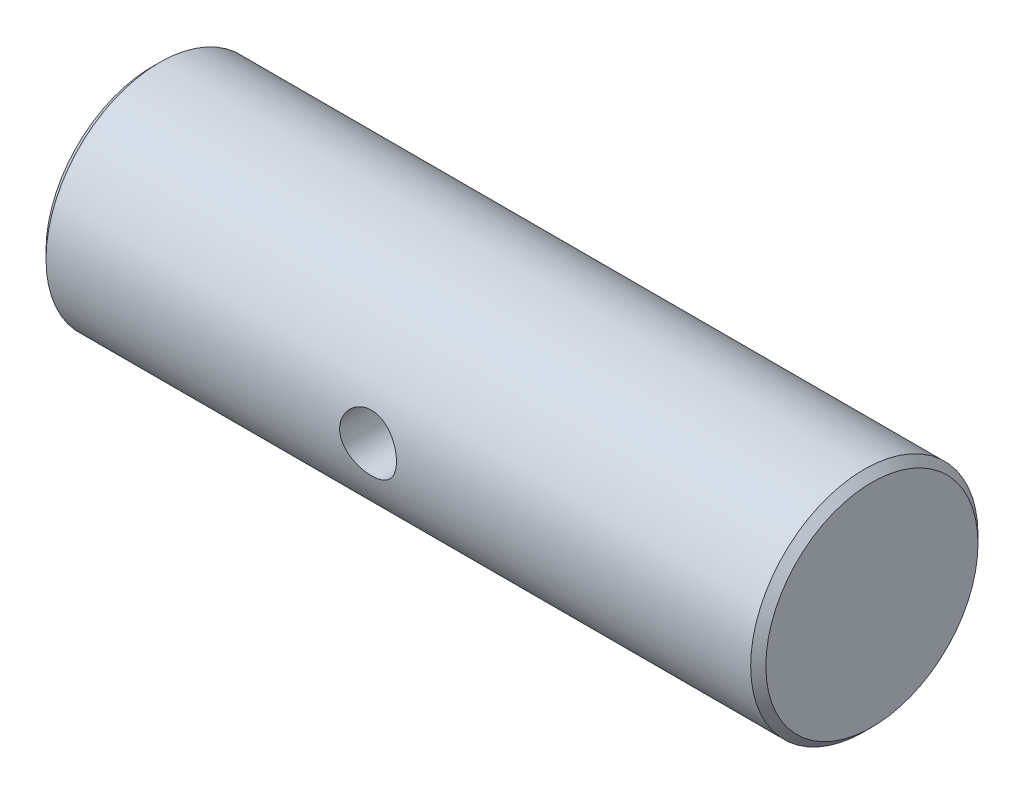
ISO-10303-21;
HEADER;
FILE_DESCRIPTION(('STEP AP214'),'2;1');
FILE_NAME('part.step','',(''),(''),'','','');
FILE_SCHEMA(('AUTOMOTIVE_DESIGN { 1 0 10303 214 1 1 1 1 }'));
ENDSEC;
DATA;
#1=APPLICATION_CONTEXT('core data for automotive mechanical design processes');
#2=APPLICATION_PROTOCOL_DEFINITION('international standard','automotive_design',2000,#1);
#3=PRODUCT_CONTEXT('',#1,'mechanical');
#4=PRODUCT('Part','Part','',(#3));
#5=PRODUCT_RELATED_PRODUCT_CATEGORY('part','',(#4));
#6=PRODUCT_DEFINITION_FORMATION('','',#4);
#7=PRODUCT_DEFINITION_CONTEXT('part definition',#1,'design');
#8=PRODUCT_DEFINITION('design','',#6,#7);
#9=PRODUCT_DEFINITION_SHAPE('','',#8);
#10=(LENGTH_UNIT() NAMED_UNIT(*) SI_UNIT(.MILLI.,.METRE.));
#11=(NAMED_UNIT(*) PLANE_ANGLE_UNIT() SI_UNIT($,.RADIAN.));
#12=(NAMED_UNIT(*) SI_UNIT($,.STERADIAN.) SOLID_ANGLE_UNIT());
#13=UNCERTAINTY_MEASURE_WITH_UNIT(LENGTH_MEASURE(1.E-05),#10,'distance_accuracy_value','');
#14=(GEOMETRIC_REPRESENTATION_CONTEXT(3) GLOBAL_UNCERTAINTY_ASSIGNED_CONTEXT((#13)) GLOBAL_UNIT_ASSIGNED_CONTEXT((#10,
#11,#12)) REPRESENTATION_CONTEXT('',''));
#15=CARTESIAN_POINT('',(0.,0.,0.));
#16=DIRECTION('',(0.,0.,1.));
#17=DIRECTION('',(1.,0.,0.));
#18=AXIS2_PLACEMENT_3D('',#15,#16,#17);
#19=CARTESIAN_POINT('',(-15.,3.,0.));
#20=DIRECTION('',(1.,0.,0.));
#21=DIRECTION('',(0.,0.,-1.));
#22=AXIS2_PLACEMENT_3D('',#19,#20,#21);
#23=PLANE('',#22);
#24=CARTESIAN_POINT('',(-15.,0.,0.));
#25=DIRECTION('',(1.,0.,0.));
#26=DIRECTION('',(0.,0.,-1.));
#27=AXIS2_PLACEMENT_3D('',#24,#25,#26);
#28=CIRCLE('',#27,2.80000000000001);
#29=CARTESIAN_POINT('',(-15.,0.,-2.80000000000001));
#30=VERTEX_POINT('',#29);
#31=EDGE_CURVE('E45',#30,#30,#28,.F.);
#32=ORIENTED_EDGE('',*,*,#31,.T.);
#33=EDGE_LOOP('',(#32));
#34=FACE_BOUND('',#33,.T.);
#35=ADVANCED_FACE('F30',(#34),#23,.F.);
#36=CARTESIAN_POINT('',(4.,3.,0.));
#37=DIRECTION('',(-1.,0.,0.));
#38=DIRECTION('',(0.,0.,1.));
#39=AXIS2_PLACEMENT_3D('',#36,#37,#38);
#40=PLANE('',#39);
#41=CARTESIAN_POINT('',(4.,0.,0.));
#42=DIRECTION('',(-1.,0.,0.));
#43=DIRECTION('',(0.,0.,1.));
#44=AXIS2_PLACEMENT_3D('',#41,#42,#43);
#45=CIRCLE('',#44,2.79999999999999);
#46=CARTESIAN_POINT('',(4.,0.,2.79999999999999));
#47=VERTEX_POINT('',#46);
#48=EDGE_CURVE('E49',#47,#47,#45,.F.);
#49=ORIENTED_EDGE('',*,*,#48,.T.);
#50=EDGE_LOOP('',(#49));
#51=FACE_BOUND('',#50,.T.);
#52=ADVANCED_FACE('F69',(#51),#40,.F.);
#53=CARTESIAN_POINT('',(-15.,0.,0.));
#54=DIRECTION('',(-1.,0.,0.));
#55=DIRECTION('',(0.,0.,1.));
#56=AXIS2_PLACEMENT_3D('',#53,#54,#55);
#57=CYLINDRICAL_SURFACE('',#56,3.);
#58=CARTESIAN_POINT('',(-5.55,0.,-3.));
#59=CARTESIAN_POINT('',(-5.55000116286908,0.0414380443348656,-2.99999929934006));
#60=CARTESIAN_POINT('',(-5.55344577538689,0.0828890789153816,-2.99913289065914));
#61=CARTESIAN_POINT('',(-5.5671125756535,0.164603161885266,-2.99576056914946));
#62=CARTESIAN_POINT('',(-5.57733860476892,0.20486552343537,-2.99325372709984));
#63=CARTESIAN_POINT('',(-5.60421962673104,0.283010436091289,-2.9868781316602));
#64=CARTESIAN_POINT('',(-5.62086689935764,0.320895781715001,-2.98301101421043));
#65=CARTESIAN_POINT('',(-5.66009069502241,0.393336065952213,-2.97432671903796));
#66=CARTESIAN_POINT('',(-5.68266741805946,0.42789089217438,-2.96950950927025));
#67=CARTESIAN_POINT('',(-5.7336003948271,0.49340096365046,-2.95933706795901));
#68=CARTESIAN_POINT('',(-5.76205578747959,0.524277845030536,-2.95397353574266));
#69=CARTESIAN_POINT('',(-5.82372610245446,0.580874463601653,-2.94336810058765));
#70=CARTESIAN_POINT('',(-5.85694156147325,0.606593618474568,-2.93812621144174));
#71=CARTESIAN_POINT('',(-5.92779761336872,0.652513271399516,-2.92827387849855));
#72=CARTESIAN_POINT('',(-5.9654966154052,0.672626107962678,-2.92367397235302));
#73=CARTESIAN_POINT('',(-6.04387420582918,0.706198454275264,-2.91574747406111));
#74=CARTESIAN_POINT('',(-6.08455231666288,0.719659027719666,-2.91242067836394));
#75=CARTESIAN_POINT('',(-6.16687174910123,0.739277418402145,-2.90750238358775));
#76=CARTESIAN_POINT('',(-6.2084774480249,0.745576134166669,-2.90587745537713));
#77=CARTESIAN_POINT('',(-6.29218428450699,0.751130887533926,-2.9044468126887));
#78=CARTESIAN_POINT('',(-6.3342853403493,0.750388070908989,-2.90464080224322));
#79=CARTESIAN_POINT('',(-6.41670790387224,0.74199326231964,-2.90679602748309));
#80=CARTESIAN_POINT('',(-6.45704781073255,0.73450917009526,-2.9087143150094));
#81=CARTESIAN_POINT('',(-6.53588052545564,0.713112093451553,-2.91403354838242));
#82=CARTESIAN_POINT('',(-6.57437320151449,0.699198651034712,-2.91743459985348));
#83=CARTESIAN_POINT('',(-6.64886900812603,0.665194738968577,-2.92537556952093));
#84=CARTESIAN_POINT('',(-6.68484308589477,0.645043333616455,-2.9299266373471));
#85=CARTESIAN_POINT('',(-6.75295935487842,0.599178138007477,-2.93964855423193));
#86=CARTESIAN_POINT('',(-6.78510087403363,0.57346337440442,-2.94481951167367));
#87=CARTESIAN_POINT('',(-6.8456018078472,0.516331712340609,-2.9553794026989));
#88=CARTESIAN_POINT('',(-6.87382724503067,0.48477312908293,-2.96077034738986));
#89=CARTESIAN_POINT('',(-6.92461062123195,0.41730595875185,-2.97102982789393));
#90=CARTESIAN_POINT('',(-6.94716838713178,0.381397238853972,-2.97589834774708));
#91=CARTESIAN_POINT('',(-6.98602529311219,0.306057944340696,-2.98458866047091));
#92=CARTESIAN_POINT('',(-7.00230267012721,0.266615696604312,-2.98840680063862));
#93=CARTESIAN_POINT('',(-7.02795865285478,0.185438004071441,-2.99453958495709));
#94=CARTESIAN_POINT('',(-7.03733857820907,0.143702999575242,-2.9968545166964));
#95=CARTESIAN_POINT('',(-7.04872878277942,0.0602699851950133,-2.99967749635687));
#96=CARTESIAN_POINT('',(-7.05092151303765,0.0185983599941048,-3.00023026754139));
#97=CARTESIAN_POINT('',(-7.04837549897225,-0.0645164374007541,-2.99959402407225));
#98=CARTESIAN_POINT('',(-7.04363737860043,-0.105959629822298,-2.99840516620923));
#99=CARTESIAN_POINT('',(-7.02751454580431,-0.186807134388246,-2.99444790563678));
#100=CARTESIAN_POINT('',(-7.0162293682615,-0.226232559484378,-2.99170317092906));
#101=CARTESIAN_POINT('',(-6.98744645798577,-0.302628646226256,-2.98494353317067));
#102=CARTESIAN_POINT('',(-6.96994809784341,-0.339599059516318,-2.98092850184946));
#103=CARTESIAN_POINT('',(-6.92888193556263,-0.410761567214924,-2.97196653963155));
#104=CARTESIAN_POINT('',(-6.90521194380162,-0.444892720917915,-2.96700433683466));
#105=CARTESIAN_POINT('',(-6.85260504560151,-0.508763306821623,-2.9567225459371));
#106=CARTESIAN_POINT('',(-6.82366723019154,-0.538501979486504,-2.95140289625852));
#107=CARTESIAN_POINT('',(-6.76049901957777,-0.593495284036365,-2.94084478480386));
#108=CARTESIAN_POINT('',(-6.72615614849879,-0.618621933811016,-2.9356115209364));
#109=CARTESIAN_POINT('',(-6.65363368276714,-0.662755379506349,-2.92596439188619));
#110=CARTESIAN_POINT('',(-6.61545425852012,-0.681762447078968,-2.92155049033513));
#111=CARTESIAN_POINT('',(-6.53654713879346,-0.712975710304646,-2.91409047367332));
#112=CARTESIAN_POINT('',(-6.49583618582799,-0.725222198327033,-2.91103627645953));
#113=CARTESIAN_POINT('',(-6.41284518105544,-0.74267282997689,-2.90663372045092));
#114=CARTESIAN_POINT('',(-6.37056547448375,-0.747878513739329,-2.90528498859968));
#115=CARTESIAN_POINT('',(-6.2869394880724,-0.751019295166997,-2.90447450601978));
#116=CARTESIAN_POINT('',(-6.24560128243763,-0.749158948890059,-2.90495966364132));
#117=CARTESIAN_POINT('',(-6.16384805566601,-0.738688639156434,-2.90763954503921));
#118=CARTESIAN_POINT('',(-6.12343301599317,-0.730078811343385,-2.90983423445928));
#119=CARTESIAN_POINT('',(-6.04489577046729,-0.706465659721397,-2.91565630341361));
#120=CARTESIAN_POINT('',(-6.00676134737989,-0.691500702340188,-2.91927507618155));
#121=CARTESIAN_POINT('',(-5.93351730864315,-0.655632456802535,-2.92753877862414));
#122=CARTESIAN_POINT('',(-5.89840811340654,-0.634728345017094,-2.93218385060386));
#123=CARTESIAN_POINT('',(-5.83122268549899,-0.586933874318568,-2.94212817131756));
#124=CARTESIAN_POINT('',(-5.79924946328802,-0.559901581456127,-2.94744132415878));
#125=CARTESIAN_POINT('',(-5.74022647760229,-0.500894685594867,-2.95804013623143));
#126=CARTESIAN_POINT('',(-5.71317788494351,-0.468918910630572,-2.9633257886353));
#127=CARTESIAN_POINT('',(-5.66429434571769,-0.400233793351295,-2.97338827823831));
#128=CARTESIAN_POINT('',(-5.64256269316421,-0.363449211158193,-2.97815416682934));
#129=CARTESIAN_POINT('',(-5.60562626852973,-0.286633029755238,-2.98652462487559));
#130=CARTESIAN_POINT('',(-5.59041681967573,-0.246603781718369,-2.99013002599891));
#131=CARTESIAN_POINT('',(-5.56921408483517,-0.172205126621735,-2.99524029782771));
#132=CARTESIAN_POINT('',(-5.56202437847328,-0.138190085454034,-2.99701292526345));
#133=CARTESIAN_POINT('',(-5.55241702818903,-0.0694530357681415,-2.99939302615974));
#134=CARTESIAN_POINT('',(-5.54999902534735,-0.0347310806213081,-3.00000058725447));
#135=CARTESIAN_POINT('',(-5.55,0.,-3.));
#136=B_SPLINE_CURVE_WITH_KNOTS('',3,(#58,#59,#60,#61,#62,#63,#64,#65,#66,#67,#68,#69,#70,#71,
#72,#73,#74,#75,#76,#77,#78,#79,#80,#81,#82,#83,#84,#85,#86,#87,#88,#89,#90,#91,#92,#93,#94,#95,
#96,#97,#98,#99,#100,#101,#102,#103,#104,#105,#106,#107,#108,#109,#110,#111,#112,#113,#114,#115,
#116,#117,#118,#119,#120,#121,#122,#123,#124,#125,#126,#127,#128,#129,#130,#131,#132,#133,#134,
#135),.UNSPECIFIED.,.T.,.F.,(4,2,2,2,2,2,2,2,2,2,2,2,2,2,2,2,2,2,2,2,2,2,2,2,2,2,2,2,2,2,2,2,2,
2,2,2,2,2,4),(0.,0.124186856235945,0.24844411888195,0.372552451143053,0.496664970084664,
0.623072177185695,0.74949364790031,0.877793237729035,1.00607230584684,1.13178147549715,
1.25747019056348,1.38011248503509,1.50276351733019,1.6266526393694,1.75056345418081,
1.8780075048451,2.00545544779124,2.13334114504557,2.26120236844321,2.38579154474638,
2.51036950556371,2.63310137257019,2.75584563661145,2.88076793782676,3.00571181504009,
3.13372254602238,3.26172759374754,3.38896127307018,3.51616711626204,3.63971890199306,
3.76326820478017,3.88608200279724,4.00891284068451,4.13494788204955,4.26101284885209,
4.38936092749794,4.51761681910675,4.62171121471075,4.7257977802152),.UNSPECIFIED.);
#137=CARTESIAN_POINT('',(-5.55,0.,-3.));
#138=VERTEX_POINT('',#137);
#139=EDGE_CURVE('E10',#138,#138,#136,.T.);
#140=ORIENTED_EDGE('',*,*,#139,.T.);
#141=EDGE_LOOP('',(#140));
#142=FACE_BOUND('',#141,.T.);
#143=CARTESIAN_POINT('',(-5.55,0.,3.));
#144=CARTESIAN_POINT('',(-5.55000116286908,-0.0414380443348656,2.99999929934006));
#145=CARTESIAN_POINT('',(-5.55344577538689,-0.0828890789153816,2.99913289065914));
#146=CARTESIAN_POINT('',(-5.5671125756535,-0.164603161885266,2.99576056914946));
#147=CARTESIAN_POINT('',(-5.57733860476892,-0.20486552343537,2.99325372709984));
#148=CARTESIAN_POINT('',(-5.60421962673104,-0.283010436091289,2.9868781316602));
#149=CARTESIAN_POINT('',(-5.62086689935764,-0.320895781715001,2.98301101421043));
#150=CARTESIAN_POINT('',(-5.66009069502241,-0.393336065952213,2.97432671903796));
#151=CARTESIAN_POINT('',(-5.68266741805946,-0.42789089217438,2.96950950927025));
#152=CARTESIAN_POINT('',(-5.7336003948271,-0.49340096365046,2.95933706795901));
#153=CARTESIAN_POINT('',(-5.76205578747959,-0.524277845030536,2.95397353574266));
#154=CARTESIAN_POINT('',(-5.82372610245446,-0.580874463601653,2.94336810058765));
#155=CARTESIAN_POINT('',(-5.85694156147325,-0.606593618474568,2.93812621144174));
#156=CARTESIAN_POINT('',(-5.92779761336872,-0.652513271399516,2.92827387849855));
#157=CARTESIAN_POINT('',(-5.9654966154052,-0.672626107962678,2.92367397235302));
#158=CARTESIAN_POINT('',(-6.04387420582918,-0.706198454275264,2.91574747406111));
#159=CARTESIAN_POINT('',(-6.08455231666288,-0.719659027719666,2.91242067836394));
#160=CARTESIAN_POINT('',(-6.16687174910123,-0.739277418402145,2.90750238358775));
#161=CARTESIAN_POINT('',(-6.2084774480249,-0.745576134166669,2.90587745537713));
#162=CARTESIAN_POINT('',(-6.29218428450699,-0.751130887533926,2.9044468126887));
#163=CARTESIAN_POINT('',(-6.3342853403493,-0.750388070908989,2.90464080224322));
#164=CARTESIAN_POINT('',(-6.41670790387224,-0.74199326231964,2.90679602748309));
#165=CARTESIAN_POINT('',(-6.45704781073255,-0.73450917009526,2.9087143150094));
#166=CARTESIAN_POINT('',(-6.53588052545564,-0.713112093451553,2.91403354838242));
#167=CARTESIAN_POINT('',(-6.57437320151449,-0.699198651034712,2.91743459985348));
#168=CARTESIAN_POINT('',(-6.64886900812603,-0.665194738968577,2.92537556952093));
#169=CARTESIAN_POINT('',(-6.68484308589477,-0.645043333616455,2.9299266373471));
#170=CARTESIAN_POINT('',(-6.75295935487842,-0.599178138007477,2.93964855423193));
#171=CARTESIAN_POINT('',(-6.78510087403363,-0.57346337440442,2.94481951167367));
#172=CARTESIAN_POINT('',(-6.8456018078472,-0.516331712340609,2.9553794026989));
#173=CARTESIAN_POINT('',(-6.87382724503067,-0.48477312908293,2.96077034738986));
#174=CARTESIAN_POINT('',(-6.92461062123195,-0.41730595875185,2.97102982789393));
#175=CARTESIAN_POINT('',(-6.94716838713178,-0.381397238853972,2.97589834774708));
#176=CARTESIAN_POINT('',(-6.98602529311219,-0.306057944340696,2.98458866047091));
#177=CARTESIAN_POINT('',(-7.00230267012721,-0.266615696604312,2.98840680063862));
#178=CARTESIAN_POINT('',(-7.02795865285478,-0.185438004071441,2.99453958495709));
#179=CARTESIAN_POINT('',(-7.03733857820907,-0.143702999575242,2.9968545166964));
#180=CARTESIAN_POINT('',(-7.04872878277942,-0.0602699851950133,2.99967749635687));
#181=CARTESIAN_POINT('',(-7.05092151303765,-0.0185983599941048,3.00023026754139));
#182=CARTESIAN_POINT('',(-7.04837549897225,0.0645164374007541,2.99959402407225));
#183=CARTESIAN_POINT('',(-7.04363737860043,0.105959629822298,2.99840516620923));
#184=CARTESIAN_POINT('',(-7.02751454580431,0.186807134388246,2.99444790563678));
#185=CARTESIAN_POINT('',(-7.0162293682615,0.226232559484378,2.99170317092906));
#186=CARTESIAN_POINT('',(-6.98744645798577,0.302628646226256,2.98494353317067));
#187=CARTESIAN_POINT('',(-6.96994809784341,0.339599059516318,2.98092850184946));
#188=CARTESIAN_POINT('',(-6.92888193556263,0.410761567214924,2.97196653963155));
#189=CARTESIAN_POINT('',(-6.90521194380162,0.444892720917915,2.96700433683466));
#190=CARTESIAN_POINT('',(-6.85260504560151,0.508763306821623,2.9567225459371));
#191=CARTESIAN_POINT('',(-6.82366723019154,0.538501979486504,2.95140289625852));
#192=CARTESIAN_POINT('',(-6.76049901957777,0.593495284036365,2.94084478480386));
#193=CARTESIAN_POINT('',(-6.72615614849879,0.618621933811016,2.9356115209364));
#194=CARTESIAN_POINT('',(-6.65363368276714,0.662755379506349,2.92596439188619));
#195=CARTESIAN_POINT('',(-6.61545425852012,0.681762447078968,2.92155049033513));
#196=CARTESIAN_POINT('',(-6.53654713879346,0.712975710304646,2.91409047367332));
#197=CARTESIAN_POINT('',(-6.49583618582799,0.725222198327033,2.91103627645953));
#198=CARTESIAN_POINT('',(-6.41284518105544,0.74267282997689,2.90663372045092));
#199=CARTESIAN_POINT('',(-6.37056547448375,0.747878513739329,2.90528498859968));
#200=CARTESIAN_POINT('',(-6.2869394880724,0.751019295166997,2.90447450601978));
#201=CARTESIAN_POINT('',(-6.24560128243763,0.749158948890059,2.90495966364132));
#202=CARTESIAN_POINT('',(-6.16384805566601,0.738688639156434,2.90763954503921));
#203=CARTESIAN_POINT('',(-6.12343301599317,0.730078811343385,2.90983423445928));
#204=CARTESIAN_POINT('',(-6.04489577046729,0.706465659721397,2.91565630341361));
#205=CARTESIAN_POINT('',(-6.00676134737989,0.691500702340188,2.91927507618155));
#206=CARTESIAN_POINT('',(-5.93351730864315,0.655632456802535,2.92753877862414));
#207=CARTESIAN_POINT('',(-5.89840811340654,0.634728345017094,2.93218385060386));
#208=CARTESIAN_POINT('',(-5.83122268549899,0.586933874318568,2.94212817131756));
#209=CARTESIAN_POINT('',(-5.79924946328802,0.559901581456127,2.94744132415878));
#210=CARTESIAN_POINT('',(-5.74022647760229,0.500894685594867,2.95804013623143));
#211=CARTESIAN_POINT('',(-5.71317788494351,0.468918910630572,2.9633257886353));
#212=CARTESIAN_POINT('',(-5.66429434571769,0.400233793351295,2.97338827823831));
#213=CARTESIAN_POINT('',(-5.64256269316421,0.363449211158193,2.97815416682934));
#214=CARTESIAN_POINT('',(-5.60562626852973,0.286633029755238,2.98652462487559));
#215=CARTESIAN_POINT('',(-5.59041681967573,0.246603781718369,2.99013002599891));
#216=CARTESIAN_POINT('',(-5.56921408483517,0.172205126621735,2.99524029782771));
#217=CARTESIAN_POINT('',(-5.56202437847328,0.138190085454034,2.99701292526345));
#218=CARTESIAN_POINT('',(-5.55241702818903,0.0694530357681415,2.99939302615974));
#219=CARTESIAN_POINT('',(-5.54999902534735,0.0347310806213081,3.00000058725447));
#220=CARTESIAN_POINT('',(-5.55,0.,3.));
#221=B_SPLINE_CURVE_WITH_KNOTS('',3,(#143,#144,#145,#146,#147,#148,#149,#150,#151,#152,#153,
#154,#155,#156,#157,#158,#159,#160,#161,#162,#163,#164,#165,#166,#167,#168,#169,#170,#171,#172,
#173,#174,#175,#176,#177,#178,#179,#180,#181,#182,#183,#184,#185,#186,#187,#188,#189,#190,#191,
#192,#193,#194,#195,#196,#197,#198,#199,#200,#201,#202,#203,#204,#205,#206,#207,#208,#209,#210,
#211,#212,#213,#214,#215,#216,#217,#218,#219,#220),.UNSPECIFIED.,.T.,.F.,(4,2,2,2,2,2,2,2,2,2,2,
2,2,2,2,2,2,2,2,2,2,2,2,2,2,2,2,2,2,2,2,2,2,2,2,2,2,2,4),(0.,0.124186856235945,0.24844411888195,
0.372552451143053,0.496664970084664,0.623072177185695,0.74949364790031,0.877793237729035,
1.00607230584684,1.13178147549715,1.25747019056348,1.38011248503509,1.50276351733019,
1.6266526393694,1.75056345418081,1.8780075048451,2.00545544779124,2.13334114504557,
2.26120236844321,2.38579154474638,2.51036950556371,2.63310137257019,2.75584563661145,
2.88076793782676,3.00571181504009,3.13372254602238,3.26172759374754,3.38896127307018,
3.51616711626204,3.63971890199306,3.76326820478017,3.88608200279724,4.00891284068451,
4.13494788204955,4.26101284885209,4.38936092749794,4.51761681910675,4.62171121471075,
4.7257977802152),.UNSPECIFIED.);
#222=CARTESIAN_POINT('',(-5.55,0.,3.));
#223=VERTEX_POINT('',#222);
#224=EDGE_CURVE('E41',#223,#223,#221,.T.);
#225=ORIENTED_EDGE('',*,*,#224,.T.);
#226=EDGE_LOOP('',(#225));
#227=FACE_BOUND('',#226,.T.);
#228=CARTESIAN_POINT('',(3.8,0.,0.));
#229=DIRECTION('',(-1.,0.,0.));
#230=DIRECTION('',(0.,0.,1.));
#231=AXIS2_PLACEMENT_3D('',#228,#229,#230);
#232=CIRCLE('',#231,3.);
#233=CARTESIAN_POINT('',(3.8,0.,3.));
#234=VERTEX_POINT('',#233);
#235=EDGE_CURVE('E86',#234,#234,#232,.T.);
#236=ORIENTED_EDGE('',*,*,#235,.T.);
#237=EDGE_LOOP('',(#236));
#238=FACE_BOUND('',#237,.T.);
#239=CARTESIAN_POINT('',(-14.8,0.,0.));
#240=DIRECTION('',(1.,0.,0.));
#241=DIRECTION('',(0.,0.,-1.));
#242=AXIS2_PLACEMENT_3D('',#239,#240,#241);
#243=CIRCLE('',#242,3.);
#244=CARTESIAN_POINT('',(-14.8,0.,-3.));
#245=VERTEX_POINT('',#244);
#246=EDGE_CURVE('E88',#245,#245,#243,.T.);
#247=ORIENTED_EDGE('',*,*,#246,.T.);
#248=EDGE_LOOP('',(#247));
#249=FACE_BOUND('',#248,.T.);
#250=ADVANCED_FACE('F54',(#142,#227,#238,#249),#57,.T.);
#251=CARTESIAN_POINT('',(3.8,0.,0.));
#252=DIRECTION('',(-1.,0.,0.));
#253=DIRECTION('',(0.,0.,1.));
#254=AXIS2_PLACEMENT_3D('',#251,#252,#253);
#255=CONICAL_SURFACE('',#254,3.,0.785398163397458);
#256=ORIENTED_EDGE('',*,*,#48,.F.);
#257=EDGE_LOOP('',(#256));
#258=FACE_BOUND('',#257,.T.);
#259=ORIENTED_EDGE('',*,*,#235,.F.);
#260=EDGE_LOOP('',(#259));
#261=FACE_BOUND('',#260,.T.);
#262=ADVANCED_FACE('F65',(#258,#261),#255,.T.);
#263=CARTESIAN_POINT('',(-15.,0.,0.));
#264=DIRECTION('',(1.,0.,0.));
#265=DIRECTION('',(0.,0.,-1.));
#266=AXIS2_PLACEMENT_3D('',#263,#264,#265);
#267=CONICAL_SURFACE('',#266,2.80000000000001,0.785398163397453);
#268=ORIENTED_EDGE('',*,*,#246,.F.);
#269=EDGE_LOOP('',(#268));
#270=FACE_BOUND('',#269,.T.);
#271=ORIENTED_EDGE('',*,*,#31,.F.);
#272=EDGE_LOOP('',(#271));
#273=FACE_BOUND('',#272,.T.);
#274=ADVANCED_FACE('F32',(#270,#273),#267,.T.);
#275=CARTESIAN_POINT('',(-6.3,0.,-3.));
#276=DIRECTION('',(0.,0.,1.));
#277=DIRECTION('',(1.,0.,0.));
#278=AXIS2_PLACEMENT_3D('',#275,#276,#277);
#279=CYLINDRICAL_SURFACE('',#278,0.75);
#280=ORIENTED_EDGE('',*,*,#224,.F.);
#281=EDGE_LOOP('',(#280));
#282=FACE_BOUND('',#281,.T.);
#283=ORIENTED_EDGE('',*,*,#139,.F.);
#284=EDGE_LOOP('',(#283));
#285=FACE_BOUND('',#284,.T.);
#286=ADVANCED_FACE('F57',(#282,#285),#279,.F.);
#287=CLOSED_SHELL('',(#35,#52,#250,#262,#274,#286));
#288=MANIFOLD_SOLID_BREP('B2',#287);
#289=ADVANCED_BREP_SHAPE_REPRESENTATION('',(#18,#288),#14);
#290=SHAPE_DEFINITION_REPRESENTATION(#9,#289);
ENDSEC;
END-ISO-10303-21;
